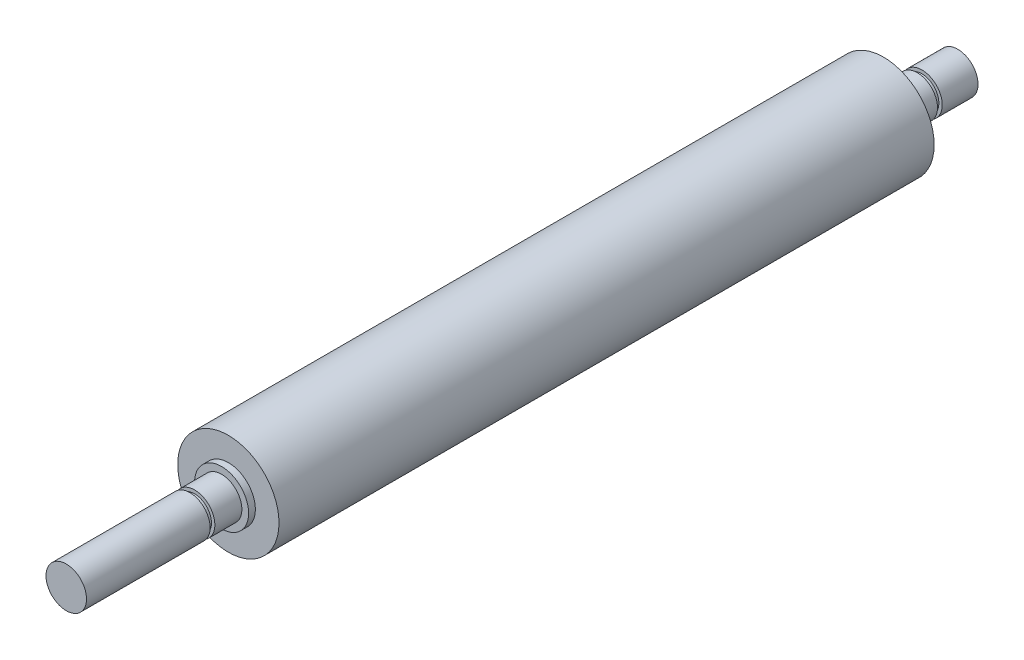
ISO-10303-21;
HEADER;
FILE_DESCRIPTION(('STEP AP214'),'2;1');
FILE_NAME('part.step','',(''),(''),'','','');
FILE_SCHEMA(('AUTOMOTIVE_DESIGN { 1 0 10303 214 1 1 1 1 }'));
ENDSEC;
DATA;
#1=APPLICATION_CONTEXT('core data for automotive mechanical design processes');
#2=APPLICATION_PROTOCOL_DEFINITION('international standard','automotive_design',2000,#1);
#3=PRODUCT_CONTEXT('',#1,'mechanical');
#4=PRODUCT('Part','Part','',(#3));
#5=PRODUCT_RELATED_PRODUCT_CATEGORY('part','',(#4));
#6=PRODUCT_DEFINITION_FORMATION('','',#4);
#7=PRODUCT_DEFINITION_CONTEXT('part definition',#1,'design');
#8=PRODUCT_DEFINITION('design','',#6,#7);
#9=PRODUCT_DEFINITION_SHAPE('','',#8);
#10=(LENGTH_UNIT() NAMED_UNIT(*) SI_UNIT(.MILLI.,.METRE.));
#11=(NAMED_UNIT(*) PLANE_ANGLE_UNIT() SI_UNIT($,.RADIAN.));
#12=(NAMED_UNIT(*) SI_UNIT($,.STERADIAN.) SOLID_ANGLE_UNIT());
#13=UNCERTAINTY_MEASURE_WITH_UNIT(LENGTH_MEASURE(1.E-05),#10,'distance_accuracy_value','');
#14=(GEOMETRIC_REPRESENTATION_CONTEXT(3) GLOBAL_UNCERTAINTY_ASSIGNED_CONTEXT((#13)) GLOBAL_UNIT_ASSIGNED_CONTEXT((#10,
#11,#12)) REPRESENTATION_CONTEXT('',''));
#15=CARTESIAN_POINT('',(0.,0.,0.));
#16=DIRECTION('',(0.,0.,1.));
#17=DIRECTION('',(1.,0.,0.));
#18=AXIS2_PLACEMENT_3D('',#15,#16,#17);
#19=CARTESIAN_POINT('',(0.,0.,-11.));
#20=DIRECTION('',(0.,0.,1.));
#21=DIRECTION('',(1.,0.,0.));
#22=AXIS2_PLACEMENT_3D('',#19,#20,#21);
#23=CYLINDRICAL_SURFACE('',#22,3.);
#24=CARTESIAN_POINT('',(0.,0.,-1.));
#25=DIRECTION('',(0.,0.,-1.));
#26=DIRECTION('',(-1.,0.,0.));
#27=AXIS2_PLACEMENT_3D('',#24,#25,#26);
#28=CIRCLE('',#27,3.);
#29=CARTESIAN_POINT('',(-3.,0.,-1.));
#30=VERTEX_POINT('',#29);
#31=EDGE_CURVE('E87',#30,#30,#28,.T.);
#32=ORIENTED_EDGE('',*,*,#31,.T.);
#33=EDGE_LOOP('',(#32));
#34=FACE_BOUND('',#33,.T.);
#35=CARTESIAN_POINT('',(0.,0.,-5.));
#36=DIRECTION('',(0.,0.,-1.));
#37=DIRECTION('',(-1.,0.,0.));
#38=AXIS2_PLACEMENT_3D('',#35,#36,#37);
#39=CIRCLE('',#38,3.);
#40=CARTESIAN_POINT('',(-3.,0.,-5.));
#41=VERTEX_POINT('',#40);
#42=EDGE_CURVE('E52',#41,#41,#39,.T.);
#43=ORIENTED_EDGE('',*,*,#42,.F.);
#44=EDGE_LOOP('',(#43));
#45=FACE_BOUND('',#44,.T.);
#46=ADVANCED_FACE('F35',(#34,#45),#23,.T.);
#47=CARTESIAN_POINT('',(0.,0.,97.));
#48=DIRECTION('',(0.,0.,-1.));
#49=DIRECTION('',(-1.,0.,0.));
#50=AXIS2_PLACEMENT_3D('',#47,#48,#49);
#51=CYLINDRICAL_SURFACE('',#50,7.5);
#52=CARTESIAN_POINT('',(0.,0.,97.));
#53=DIRECTION('',(0.,0.,1.));
#54=DIRECTION('',(1.,0.,0.));
#55=AXIS2_PLACEMENT_3D('',#52,#53,#54);
#56=CIRCLE('',#55,7.5);
#57=CARTESIAN_POINT('',(7.5,0.,97.));
#58=VERTEX_POINT('',#57);
#59=EDGE_CURVE('E43',#58,#58,#56,.T.);
#60=ORIENTED_EDGE('',*,*,#59,.F.);
#61=EDGE_LOOP('',(#60));
#62=FACE_BOUND('',#61,.T.);
#63=CARTESIAN_POINT('',(0.,0.,0.));
#64=DIRECTION('',(0.,0.,1.));
#65=DIRECTION('',(1.,0.,0.));
#66=AXIS2_PLACEMENT_3D('',#63,#64,#65);
#67=CIRCLE('',#66,7.5);
#68=CARTESIAN_POINT('',(7.5,0.,0.));
#69=VERTEX_POINT('',#68);
#70=EDGE_CURVE('E48',#69,#69,#67,.T.);
#71=ORIENTED_EDGE('',*,*,#70,.T.);
#72=EDGE_LOOP('',(#71));
#73=FACE_BOUND('',#72,.T.);
#74=ADVANCED_FACE('F37',(#62,#73),#51,.T.);
#75=CARTESIAN_POINT('',(0.,0.,97.));
#76=DIRECTION('',(0.,0.,1.));
#77=DIRECTION('',(1.,0.,0.));
#78=AXIS2_PLACEMENT_3D('',#75,#76,#77);
#79=PLANE('',#78);
#80=CARTESIAN_POINT('',(0.,0.,97.));
#81=DIRECTION('',(0.,0.,1.));
#82=DIRECTION('',(1.,0.,0.));
#83=AXIS2_PLACEMENT_3D('',#80,#81,#82);
#84=CIRCLE('',#83,4.);
#85=CARTESIAN_POINT('',(4.,0.,97.));
#86=VERTEX_POINT('',#85);
#87=EDGE_CURVE('E81',#86,#86,#84,.T.);
#88=ORIENTED_EDGE('',*,*,#87,.F.);
#89=EDGE_LOOP('',(#88));
#90=FACE_BOUND('',#89,.T.);
#91=ORIENTED_EDGE('',*,*,#59,.T.);
#92=EDGE_LOOP('',(#91));
#93=FACE_BOUND('',#92,.T.);
#94=ADVANCED_FACE('F106',(#90,#93),#79,.T.);
#95=CARTESIAN_POINT('',(0.,0.,0.));
#96=DIRECTION('',(0.,0.,1.));
#97=DIRECTION('',(1.,0.,0.));
#98=AXIS2_PLACEMENT_3D('',#95,#96,#97);
#99=PLANE('',#98);
#100=CARTESIAN_POINT('',(0.,0.,0.));
#101=DIRECTION('',(0.,0.,1.));
#102=DIRECTION('',(1.,0.,0.));
#103=AXIS2_PLACEMENT_3D('',#100,#101,#102);
#104=CIRCLE('',#103,4.);
#105=CARTESIAN_POINT('',(4.,0.,0.));
#106=VERTEX_POINT('',#105);
#107=EDGE_CURVE('E10',#106,#106,#104,.F.);
#108=ORIENTED_EDGE('',*,*,#107,.F.);
#109=EDGE_LOOP('',(#108));
#110=FACE_BOUND('',#109,.T.);
#111=ORIENTED_EDGE('',*,*,#70,.F.);
#112=EDGE_LOOP('',(#111));
#113=FACE_BOUND('',#112,.T.);
#114=ADVANCED_FACE('F103',(#110,#113),#99,.F.);
#115=CARTESIAN_POINT('',(0.,0.,-1.));
#116=DIRECTION('',(0.,0.,1.));
#117=DIRECTION('',(1.,0.,0.));
#118=AXIS2_PLACEMENT_3D('',#115,#116,#117);
#119=CYLINDRICAL_SURFACE('',#118,4.);
#120=CARTESIAN_POINT('',(0.,0.,-1.));
#121=DIRECTION('',(0.,0.,-1.));
#122=DIRECTION('',(-1.,0.,0.));
#123=AXIS2_PLACEMENT_3D('',#120,#121,#122);
#124=CIRCLE('',#123,4.);
#125=CARTESIAN_POINT('',(-4.,0.,-1.));
#126=VERTEX_POINT('',#125);
#127=EDGE_CURVE('E93',#126,#126,#124,.T.);
#128=ORIENTED_EDGE('',*,*,#127,.F.);
#129=EDGE_LOOP('',(#128));
#130=FACE_BOUND('',#129,.T.);
#131=ORIENTED_EDGE('',*,*,#107,.T.);
#132=EDGE_LOOP('',(#131));
#133=FACE_BOUND('',#132,.T.);
#134=ADVANCED_FACE('F105',(#130,#133),#119,.T.);
#135=CARTESIAN_POINT('',(0.,0.,-1.));
#136=DIRECTION('',(0.,0.,-1.));
#137=DIRECTION('',(-1.,0.,0.));
#138=AXIS2_PLACEMENT_3D('',#135,#136,#137);
#139=PLANE('',#138);
#140=ORIENTED_EDGE('',*,*,#31,.F.);
#141=EDGE_LOOP('',(#140));
#142=FACE_BOUND('',#141,.T.);
#143=ORIENTED_EDGE('',*,*,#127,.T.);
#144=EDGE_LOOP('',(#143));
#145=FACE_BOUND('',#144,.T.);
#146=ADVANCED_FACE('F112',(#142,#145),#139,.T.);
#147=CARTESIAN_POINT('',(0.,0.,98.));
#148=DIRECTION('',(0.,0.,-1.));
#149=DIRECTION('',(-1.,0.,0.));
#150=AXIS2_PLACEMENT_3D('',#147,#148,#149);
#151=CYLINDRICAL_SURFACE('',#150,4.);
#152=CARTESIAN_POINT('',(0.,0.,98.));
#153=DIRECTION('',(0.,0.,1.));
#154=DIRECTION('',(1.,0.,0.));
#155=AXIS2_PLACEMENT_3D('',#152,#153,#154);
#156=CIRCLE('',#155,4.);
#157=CARTESIAN_POINT('',(4.,0.,98.));
#158=VERTEX_POINT('',#157);
#159=EDGE_CURVE('E84',#158,#158,#156,.T.);
#160=ORIENTED_EDGE('',*,*,#159,.F.);
#161=EDGE_LOOP('',(#160));
#162=FACE_BOUND('',#161,.T.);
#163=ORIENTED_EDGE('',*,*,#87,.T.);
#164=EDGE_LOOP('',(#163));
#165=FACE_BOUND('',#164,.T.);
#166=ADVANCED_FACE('F170',(#162,#165),#151,.T.);
#167=CARTESIAN_POINT('',(0.,0.,98.));
#168=DIRECTION('',(0.,0.,1.));
#169=DIRECTION('',(1.,0.,0.));
#170=AXIS2_PLACEMENT_3D('',#167,#168,#169);
#171=PLANE('',#170);
#172=CARTESIAN_POINT('',(0.,0.,98.));
#173=DIRECTION('',(0.,0.,1.));
#174=DIRECTION('',(1.,0.,0.));
#175=AXIS2_PLACEMENT_3D('',#172,#173,#174);
#176=CIRCLE('',#175,3.);
#177=CARTESIAN_POINT('',(3.,0.,98.));
#178=VERTEX_POINT('',#177);
#179=EDGE_CURVE('E58',#178,#178,#176,.T.);
#180=ORIENTED_EDGE('',*,*,#179,.F.);
#181=EDGE_LOOP('',(#180));
#182=FACE_BOUND('',#181,.T.);
#183=ORIENTED_EDGE('',*,*,#159,.T.);
#184=EDGE_LOOP('',(#183));
#185=FACE_BOUND('',#184,.T.);
#186=ADVANCED_FACE('F157',(#182,#185),#171,.T.);
#187=CARTESIAN_POINT('',(0.,0.,121.));
#188=DIRECTION('',(0.,0.,-1.));
#189=DIRECTION('',(-1.,0.,0.));
#190=AXIS2_PLACEMENT_3D('',#187,#188,#189);
#191=CYLINDRICAL_SURFACE('',#190,3.);
#192=CARTESIAN_POINT('',(0.,0.,102.));
#193=DIRECTION('',(0.,0.,-1.));
#194=DIRECTION('',(-1.,0.,0.));
#195=AXIS2_PLACEMENT_3D('',#192,#193,#194);
#196=CIRCLE('',#195,3.);
#197=CARTESIAN_POINT('',(-3.,0.,102.));
#198=VERTEX_POINT('',#197);
#199=EDGE_CURVE('E59',#198,#198,#196,.T.);
#200=ORIENTED_EDGE('',*,*,#199,.T.);
#201=EDGE_LOOP('',(#200));
#202=FACE_BOUND('',#201,.T.);
#203=ORIENTED_EDGE('',*,*,#179,.T.);
#204=EDGE_LOOP('',(#203));
#205=FACE_BOUND('',#204,.T.);
#206=ADVANCED_FACE('F148',(#202,#205),#191,.T.);
#207=CARTESIAN_POINT('',(0.,0.,-5.7));
#208=DIRECTION('',(0.,0.,-1.));
#209=DIRECTION('',(-1.,0.,0.));
#210=AXIS2_PLACEMENT_3D('',#207,#208,#209);
#211=PLANE('',#210);
#212=CARTESIAN_POINT('',(0.,0.,-5.7));
#213=DIRECTION('',(0.,0.,-1.));
#214=DIRECTION('',(-1.,0.,0.));
#215=AXIS2_PLACEMENT_3D('',#212,#213,#214);
#216=CIRCLE('',#215,2.5);
#217=CARTESIAN_POINT('',(-2.5,0.,-5.7));
#218=VERTEX_POINT('',#217);
#219=EDGE_CURVE('E56',#218,#218,#216,.T.);
#220=ORIENTED_EDGE('',*,*,#219,.T.);
#221=EDGE_LOOP('',(#220));
#222=FACE_BOUND('',#221,.T.);
#223=CARTESIAN_POINT('',(0.,0.,-5.7));
#224=DIRECTION('',(0.,0.,-1.));
#225=DIRECTION('',(-1.,0.,0.));
#226=AXIS2_PLACEMENT_3D('',#223,#224,#225);
#227=CIRCLE('',#226,3.);
#228=CARTESIAN_POINT('',(-3.,0.,-5.7));
#229=VERTEX_POINT('',#228);
#230=EDGE_CURVE('E55',#229,#229,#227,.T.);
#231=ORIENTED_EDGE('',*,*,#230,.F.);
#232=EDGE_LOOP('',(#231));
#233=FACE_BOUND('',#232,.T.);
#234=ADVANCED_FACE('F145',(#222,#233),#211,.F.);
#235=CARTESIAN_POINT('',(0.,0.,-5.));
#236=DIRECTION('',(0.,0.,-1.));
#237=DIRECTION('',(-1.,0.,0.));
#238=AXIS2_PLACEMENT_3D('',#235,#236,#237);
#239=PLANE('',#238);
#240=CARTESIAN_POINT('',(0.,0.,-5.));
#241=DIRECTION('',(0.,0.,-1.));
#242=DIRECTION('',(-1.,0.,0.));
#243=AXIS2_PLACEMENT_3D('',#240,#241,#242);
#244=CIRCLE('',#243,2.5);
#245=CARTESIAN_POINT('',(-2.5,0.,-5.));
#246=VERTEX_POINT('',#245);
#247=EDGE_CURVE('E65',#246,#246,#244,.T.);
#248=ORIENTED_EDGE('',*,*,#247,.F.);
#249=EDGE_LOOP('',(#248));
#250=FACE_BOUND('',#249,.T.);
#251=ORIENTED_EDGE('',*,*,#42,.T.);
#252=EDGE_LOOP('',(#251));
#253=FACE_BOUND('',#252,.T.);
#254=ADVANCED_FACE('F147',(#250,#253),#239,.T.);
#255=CARTESIAN_POINT('',(0.,0.,-5.7));
#256=DIRECTION('',(0.,0.,1.));
#257=DIRECTION('',(1.,0.,0.));
#258=AXIS2_PLACEMENT_3D('',#255,#256,#257);
#259=CYLINDRICAL_SURFACE('',#258,2.5);
#260=ORIENTED_EDGE('',*,*,#219,.F.);
#261=EDGE_LOOP('',(#260));
#262=FACE_BOUND('',#261,.T.);
#263=ORIENTED_EDGE('',*,*,#247,.T.);
#264=EDGE_LOOP('',(#263));
#265=FACE_BOUND('',#264,.T.);
#266=ADVANCED_FACE('F139',(#262,#265),#259,.T.);
#267=CARTESIAN_POINT('',(0.,0.,-11.));
#268=DIRECTION('',(0.,0.,-1.));
#269=DIRECTION('',(-1.,0.,0.));
#270=AXIS2_PLACEMENT_3D('',#267,#268,#269);
#271=PLANE('',#270);
#272=CARTESIAN_POINT('',(0.,0.,-11.));
#273=DIRECTION('',(0.,0.,-1.));
#274=DIRECTION('',(-1.,0.,0.));
#275=AXIS2_PLACEMENT_3D('',#272,#273,#274);
#276=CIRCLE('',#275,3.);
#277=CARTESIAN_POINT('',(-3.,0.,-11.));
#278=VERTEX_POINT('',#277);
#279=EDGE_CURVE('E90',#278,#278,#276,.T.);
#280=ORIENTED_EDGE('',*,*,#279,.T.);
#281=EDGE_LOOP('',(#280));
#282=FACE_BOUND('',#281,.T.);
#283=ADVANCED_FACE('F130',(#282),#271,.T.);
#284=ORIENTED_EDGE('',*,*,#230,.T.);
#285=EDGE_LOOP('',(#284));
#286=FACE_BOUND('',#285,.T.);
#287=ORIENTED_EDGE('',*,*,#279,.F.);
#288=EDGE_LOOP('',(#287));
#289=FACE_BOUND('',#288,.T.);
#290=ADVANCED_FACE('F120',(#286,#289),#23,.T.);
#291=CARTESIAN_POINT('',(0.,0.,102.7));
#292=DIRECTION('',(0.,0.,-1.));
#293=DIRECTION('',(-1.,0.,0.));
#294=AXIS2_PLACEMENT_3D('',#291,#292,#293);
#295=PLANE('',#294);
#296=CARTESIAN_POINT('',(0.,0.,102.7));
#297=DIRECTION('',(0.,0.,-1.));
#298=DIRECTION('',(-1.,0.,0.));
#299=AXIS2_PLACEMENT_3D('',#296,#297,#298);
#300=CIRCLE('',#299,2.5);
#301=CARTESIAN_POINT('',(-2.5,0.,102.7));
#302=VERTEX_POINT('',#301);
#303=EDGE_CURVE('E61',#302,#302,#300,.T.);
#304=ORIENTED_EDGE('',*,*,#303,.F.);
#305=EDGE_LOOP('',(#304));
#306=FACE_BOUND('',#305,.T.);
#307=CARTESIAN_POINT('',(0.,0.,102.7));
#308=DIRECTION('',(0.,0.,-1.));
#309=DIRECTION('',(-1.,0.,0.));
#310=AXIS2_PLACEMENT_3D('',#307,#308,#309);
#311=CIRCLE('',#310,3.);
#312=CARTESIAN_POINT('',(-3.,0.,102.7));
#313=VERTEX_POINT('',#312);
#314=EDGE_CURVE('E39',#313,#313,#311,.T.);
#315=ORIENTED_EDGE('',*,*,#314,.T.);
#316=EDGE_LOOP('',(#315));
#317=FACE_BOUND('',#316,.T.);
#318=ADVANCED_FACE('F129',(#306,#317),#295,.T.);
#319=CARTESIAN_POINT('',(0.,0.,102.));
#320=DIRECTION('',(0.,0.,-1.));
#321=DIRECTION('',(-1.,0.,0.));
#322=AXIS2_PLACEMENT_3D('',#319,#320,#321);
#323=PLANE('',#322);
#324=CARTESIAN_POINT('',(0.,0.,102.));
#325=DIRECTION('',(0.,0.,-1.));
#326=DIRECTION('',(-1.,0.,0.));
#327=AXIS2_PLACEMENT_3D('',#324,#325,#326);
#328=CIRCLE('',#327,2.5);
#329=CARTESIAN_POINT('',(-2.5,0.,102.));
#330=VERTEX_POINT('',#329);
#331=EDGE_CURVE('E67',#330,#330,#328,.T.);
#332=ORIENTED_EDGE('',*,*,#331,.T.);
#333=EDGE_LOOP('',(#332));
#334=FACE_BOUND('',#333,.T.);
#335=ORIENTED_EDGE('',*,*,#199,.F.);
#336=EDGE_LOOP('',(#335));
#337=FACE_BOUND('',#336,.T.);
#338=ADVANCED_FACE('F136',(#334,#337),#323,.F.);
#339=CARTESIAN_POINT('',(0.,0.,102.7));
#340=DIRECTION('',(0.,0.,-1.));
#341=DIRECTION('',(-1.,0.,0.));
#342=AXIS2_PLACEMENT_3D('',#339,#340,#341);
#343=CYLINDRICAL_SURFACE('',#342,2.5);
#344=ORIENTED_EDGE('',*,*,#303,.T.);
#345=EDGE_LOOP('',(#344));
#346=FACE_BOUND('',#345,.T.);
#347=ORIENTED_EDGE('',*,*,#331,.F.);
#348=EDGE_LOOP('',(#347));
#349=FACE_BOUND('',#348,.T.);
#350=ADVANCED_FACE('F165',(#346,#349),#343,.T.);
#351=CARTESIAN_POINT('',(0.,0.,121.));
#352=DIRECTION('',(0.,0.,1.));
#353=DIRECTION('',(1.,0.,0.));
#354=AXIS2_PLACEMENT_3D('',#351,#352,#353);
#355=PLANE('',#354);
#356=CARTESIAN_POINT('',(0.,0.,121.));
#357=DIRECTION('',(0.,0.,1.));
#358=DIRECTION('',(1.,0.,0.));
#359=AXIS2_PLACEMENT_3D('',#356,#357,#358);
#360=CIRCLE('',#359,3.);
#361=CARTESIAN_POINT('',(3.,0.,121.));
#362=VERTEX_POINT('',#361);
#363=EDGE_CURVE('E78',#362,#362,#360,.T.);
#364=ORIENTED_EDGE('',*,*,#363,.T.);
#365=EDGE_LOOP('',(#364));
#366=FACE_BOUND('',#365,.T.);
#367=ADVANCED_FACE('F163',(#366),#355,.T.);
#368=ORIENTED_EDGE('',*,*,#363,.F.);
#369=EDGE_LOOP('',(#368));
#370=FACE_BOUND('',#369,.T.);
#371=ORIENTED_EDGE('',*,*,#314,.F.);
#372=EDGE_LOOP('',(#371));
#373=FACE_BOUND('',#372,.T.);
#374=ADVANCED_FACE('F159',(#370,#373),#191,.T.);
#375=CLOSED_SHELL('',(#46,#74,#94,#114,#134,#146,#166,#186,#206,#234,#254,#266,#283,#290,#318,
#338,#350,#367,#374));
#376=MANIFOLD_SOLID_BREP('B2',#375);
#377=ADVANCED_BREP_SHAPE_REPRESENTATION('',(#18,#376),#14);
#378=SHAPE_DEFINITION_REPRESENTATION(#9,#377);
ENDSEC;
END-ISO-10303-21;
